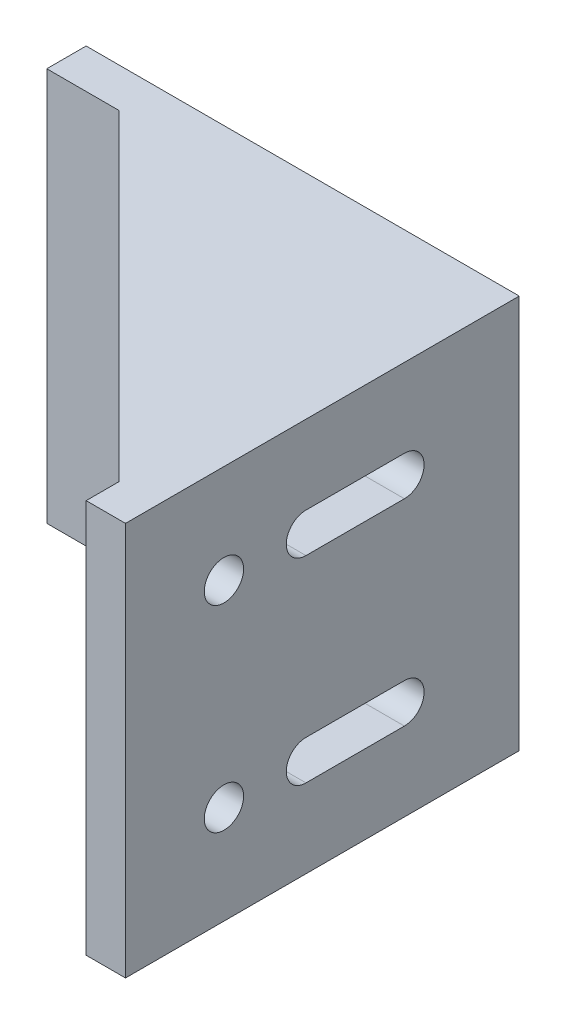
ISO-10303-21;
HEADER;
FILE_DESCRIPTION(('STEP AP214'),'2;1');
FILE_NAME('part.step','',(''),(''),'','','');
FILE_SCHEMA(('AUTOMOTIVE_DESIGN { 1 0 10303 214 1 1 1 1 }'));
ENDSEC;
DATA;
#1=APPLICATION_CONTEXT('core data for automotive mechanical design processes');
#2=APPLICATION_PROTOCOL_DEFINITION('international standard','automotive_design',2000,#1);
#3=PRODUCT_CONTEXT('',#1,'mechanical');
#4=PRODUCT('Part','Part','',(#3));
#5=PRODUCT_RELATED_PRODUCT_CATEGORY('part','',(#4));
#6=PRODUCT_DEFINITION_FORMATION('','',#4);
#7=PRODUCT_DEFINITION_CONTEXT('part definition',#1,'design');
#8=PRODUCT_DEFINITION('design','',#6,#7);
#9=PRODUCT_DEFINITION_SHAPE('','',#8);
#10=(LENGTH_UNIT() NAMED_UNIT(*) SI_UNIT(.MILLI.,.METRE.));
#11=(NAMED_UNIT(*) PLANE_ANGLE_UNIT() SI_UNIT($,.RADIAN.));
#12=(NAMED_UNIT(*) SI_UNIT($,.STERADIAN.) SOLID_ANGLE_UNIT());
#13=UNCERTAINTY_MEASURE_WITH_UNIT(LENGTH_MEASURE(1.E-05),#10,'distance_accuracy_value','');
#14=(GEOMETRIC_REPRESENTATION_CONTEXT(3) GLOBAL_UNCERTAINTY_ASSIGNED_CONTEXT((#13)) GLOBAL_UNIT_ASSIGNED_CONTEXT((#10,
#11,#12)) REPRESENTATION_CONTEXT('',''));
#15=CARTESIAN_POINT('',(0.,0.,0.));
#16=DIRECTION('',(0.,0.,1.));
#17=DIRECTION('',(1.,0.,0.));
#18=AXIS2_PLACEMENT_3D('',#15,#16,#17);
#19=CARTESIAN_POINT('',(0.,0.,6.));
#20=DIRECTION('',(0.,0.,-1.));
#21=DIRECTION('',(-1.,0.,0.));
#22=AXIS2_PLACEMENT_3D('',#19,#20,#21);
#23=PLANE('',#22);
#24=CARTESIAN_POINT('',(27.5,45.,6.));
#25=DIRECTION('',(0.,0.,1.));
#26=DIRECTION('',(1.,0.,0.));
#27=AXIS2_PLACEMENT_3D('',#24,#25,#26);
#28=CIRCLE('',#27,3.);
#29=CARTESIAN_POINT('',(27.5,48.,6.));
#30=VERTEX_POINT('',#29);
#31=CARTESIAN_POINT('',(27.5,42.,6.));
#32=VERTEX_POINT('',#31);
#33=EDGE_CURVE('E407',#30,#32,#28,.T.);
#34=ORIENTED_EDGE('',*,*,#33,.F.);
#35=DIRECTION('',(-1.,0.,0.));
#36=VECTOR('',#35,1.);
#37=CARTESIAN_POINT('',(27.5,48.,6.));
#38=LINE('',#37,#36);
#39=CARTESIAN_POINT('',(42.5,48.,6.));
#40=VERTEX_POINT('',#39);
#41=EDGE_CURVE('E415',#40,#30,#38,.T.);
#42=ORIENTED_EDGE('',*,*,#41,.F.);
#43=CARTESIAN_POINT('',(42.5,45.,6.));
#44=DIRECTION('',(0.,0.,1.));
#45=DIRECTION('',(1.,0.,0.));
#46=AXIS2_PLACEMENT_3D('',#43,#44,#45);
#47=CIRCLE('',#46,3.);
#48=CARTESIAN_POINT('',(42.5,42.,6.));
#49=VERTEX_POINT('',#48);
#50=EDGE_CURVE('E412',#49,#40,#47,.T.);
#51=ORIENTED_EDGE('',*,*,#50,.F.);
#52=DIRECTION('',(1.,0.,0.));
#53=VECTOR('',#52,1.);
#54=CARTESIAN_POINT('',(27.5,42.,6.));
#55=LINE('',#54,#53);
#56=EDGE_CURVE('E409',#32,#49,#55,.T.);
#57=ORIENTED_EDGE('',*,*,#56,.F.);
#58=EDGE_LOOP('',(#34,#42,#51,#57));
#59=FACE_BOUND('',#58,.T.);
#60=DIRECTION('',(1.,0.,0.));
#61=VECTOR('',#60,1.);
#62=CARTESIAN_POINT('',(60.,0.,6.));
#63=LINE('',#62,#61);
#64=CARTESIAN_POINT('',(0.,0.,6.));
#65=VERTEX_POINT('',#64);
#66=CARTESIAN_POINT('',(11.,0.,5.99999999999998));
#67=VERTEX_POINT('',#66);
#68=EDGE_CURVE('E236',#65,#67,#63,.T.);
#69=ORIENTED_EDGE('',*,*,#68,.T.);
#70=DIRECTION('',(0.,-1.,0.));
#71=VECTOR('',#70,1.);
#72=CARTESIAN_POINT('',(11.,3.,5.99999999999998));
#73=LINE('',#72,#71);
#74=CARTESIAN_POINT('',(11.,3.,5.99999999999998));
#75=VERTEX_POINT('',#74);
#76=EDGE_CURVE('E219',#75,#67,#73,.T.);
#77=ORIENTED_EDGE('',*,*,#76,.F.);
#78=DIRECTION('',(-1.,0.,0.));
#79=VECTOR('',#78,1.);
#80=CARTESIAN_POINT('',(0.,3.,6.));
#81=LINE('',#80,#79);
#82=CARTESIAN_POINT('',(60.,3.,6.));
#83=VERTEX_POINT('',#82);
#84=EDGE_CURVE('E224',#83,#75,#81,.T.);
#85=ORIENTED_EDGE('',*,*,#84,.F.);
#86=DIRECTION('',(0.,1.,0.));
#87=VECTOR('',#86,1.);
#88=CARTESIAN_POINT('',(60.,60.,6.));
#89=LINE('',#88,#87);
#90=CARTESIAN_POINT('',(60.,57.,6.));
#91=VERTEX_POINT('',#90);
#92=EDGE_CURVE('E230',#83,#91,#89,.T.);
#93=ORIENTED_EDGE('',*,*,#92,.T.);
#94=DIRECTION('',(1.,0.,0.));
#95=VECTOR('',#94,1.);
#96=CARTESIAN_POINT('',(0.,57.,6.));
#97=LINE('',#96,#95);
#98=CARTESIAN_POINT('',(11.,57.,6.));
#99=VERTEX_POINT('',#98);
#100=EDGE_CURVE('E262',#99,#91,#97,.T.);
#101=ORIENTED_EDGE('',*,*,#100,.F.);
#102=DIRECTION('',(0.,1.,0.));
#103=VECTOR('',#102,1.);
#104=CARTESIAN_POINT('',(11.,57.,6.));
#105=LINE('',#104,#103);
#106=CARTESIAN_POINT('',(11.,60.,6.));
#107=VERTEX_POINT('',#106);
#108=EDGE_CURVE('E268',#99,#107,#105,.T.);
#109=ORIENTED_EDGE('',*,*,#108,.T.);
#110=DIRECTION('',(-1.,0.,0.));
#111=VECTOR('',#110,1.);
#112=CARTESIAN_POINT('',(0.,60.,6.));
#113=LINE('',#112,#111);
#114=CARTESIAN_POINT('',(0.,60.,6.));
#115=VERTEX_POINT('',#114);
#116=EDGE_CURVE('E235',#107,#115,#113,.T.);
#117=ORIENTED_EDGE('',*,*,#116,.T.);
#118=DIRECTION('',(0.,-1.,0.));
#119=VECTOR('',#118,1.);
#120=CARTESIAN_POINT('',(0.,0.,6.));
#121=LINE('',#120,#119);
#122=EDGE_CURVE('E238',#115,#65,#121,.T.);
#123=ORIENTED_EDGE('',*,*,#122,.T.);
#124=EDGE_LOOP('',(#69,#77,#85,#93,#101,#109,#117,#123));
#125=FACE_BOUND('',#124,.T.);
#126=CARTESIAN_POINT('',(15.,45.,6.));
#127=DIRECTION('',(0.,0.,1.));
#128=DIRECTION('',(1.,0.,0.));
#129=AXIS2_PLACEMENT_3D('',#126,#127,#128);
#130=CIRCLE('',#129,3.);
#131=CARTESIAN_POINT('',(18.,45.,6.));
#132=VERTEX_POINT('',#131);
#133=EDGE_CURVE('E250',#132,#132,#130,.T.);
#134=ORIENTED_EDGE('',*,*,#133,.F.);
#135=EDGE_LOOP('',(#134));
#136=FACE_BOUND('',#135,.T.);
#137=CARTESIAN_POINT('',(27.5,15.,6.));
#138=DIRECTION('',(0.,0.,1.));
#139=DIRECTION('',(-1.,0.,0.));
#140=AXIS2_PLACEMENT_3D('',#137,#138,#139);
#141=CIRCLE('',#140,3.);
#142=CARTESIAN_POINT('',(27.5,18.,6.));
#143=VERTEX_POINT('',#142);
#144=CARTESIAN_POINT('',(27.5,12.,6.));
#145=VERTEX_POINT('',#144);
#146=EDGE_CURVE('E378',#143,#145,#141,.T.);
#147=ORIENTED_EDGE('',*,*,#146,.F.);
#148=DIRECTION('',(-1.,0.,0.));
#149=VECTOR('',#148,1.);
#150=CARTESIAN_POINT('',(27.5,18.,6.));
#151=LINE('',#150,#149);
#152=CARTESIAN_POINT('',(42.5,18.,6.));
#153=VERTEX_POINT('',#152);
#154=EDGE_CURVE('E385',#153,#143,#151,.T.);
#155=ORIENTED_EDGE('',*,*,#154,.F.);
#156=CARTESIAN_POINT('',(42.5,15.,6.));
#157=DIRECTION('',(0.,0.,1.));
#158=DIRECTION('',(-1.,0.,0.));
#159=AXIS2_PLACEMENT_3D('',#156,#157,#158);
#160=CIRCLE('',#159,3.);
#161=CARTESIAN_POINT('',(42.5,12.,6.));
#162=VERTEX_POINT('',#161);
#163=EDGE_CURVE('E383',#162,#153,#160,.T.);
#164=ORIENTED_EDGE('',*,*,#163,.F.);
#165=DIRECTION('',(1.,0.,0.));
#166=VECTOR('',#165,1.);
#167=CARTESIAN_POINT('',(27.5,12.,6.));
#168=LINE('',#167,#166);
#169=EDGE_CURVE('E380',#145,#162,#168,.T.);
#170=ORIENTED_EDGE('',*,*,#169,.F.);
#171=EDGE_LOOP('',(#147,#155,#164,#170));
#172=FACE_BOUND('',#171,.T.);
#173=CARTESIAN_POINT('',(15.,15.,6.));
#174=DIRECTION('',(0.,0.,1.));
#175=DIRECTION('',(-1.,0.,0.));
#176=AXIS2_PLACEMENT_3D('',#173,#174,#175);
#177=CIRCLE('',#176,3.);
#178=CARTESIAN_POINT('',(12.,15.,6.));
#179=VERTEX_POINT('',#178);
#180=EDGE_CURVE('E372',#179,#179,#177,.T.);
#181=ORIENTED_EDGE('',*,*,#180,.F.);
#182=EDGE_LOOP('',(#181));
#183=FACE_BOUND('',#182,.T.);
#184=ADVANCED_FACE('F36',(#59,#125,#136,#172,#183),#23,.F.);
#185=CARTESIAN_POINT('',(0.,0.,0.));
#186=DIRECTION('',(0.,0.,-1.));
#187=DIRECTION('',(-1.,0.,0.));
#188=AXIS2_PLACEMENT_3D('',#185,#186,#187);
#189=PLANE('',#188);
#190=DIRECTION('',(0.,1.,0.));
#191=VECTOR('',#190,1.);
#192=CARTESIAN_POINT('',(66.,0.,0.));
#193=LINE('',#192,#191);
#194=CARTESIAN_POINT('',(66.,0.,0.));
#195=VERTEX_POINT('',#194);
#196=CARTESIAN_POINT('',(66.,60.,0.));
#197=VERTEX_POINT('',#196);
#198=EDGE_CURVE('E351',#195,#197,#193,.T.);
#199=ORIENTED_EDGE('',*,*,#198,.F.);
#200=DIRECTION('',(1.,0.,0.));
#201=VECTOR('',#200,1.);
#202=CARTESIAN_POINT('',(60.,0.,0.));
#203=LINE('',#202,#201);
#204=CARTESIAN_POINT('',(0.,0.,0.));
#205=VERTEX_POINT('',#204);
#206=EDGE_CURVE('E247',#205,#195,#203,.T.);
#207=ORIENTED_EDGE('',*,*,#206,.F.);
#208=DIRECTION('',(0.,-1.,0.));
#209=VECTOR('',#208,1.);
#210=CARTESIAN_POINT('',(0.,0.,0.));
#211=LINE('',#210,#209);
#212=CARTESIAN_POINT('',(0.,60.,0.));
#213=VERTEX_POINT('',#212);
#214=EDGE_CURVE('E241',#213,#205,#211,.T.);
#215=ORIENTED_EDGE('',*,*,#214,.F.);
#216=DIRECTION('',(-1.,0.,0.));
#217=VECTOR('',#216,1.);
#218=CARTESIAN_POINT('',(0.,60.,0.));
#219=LINE('',#218,#217);
#220=EDGE_CURVE('E249',#197,#213,#219,.T.);
#221=ORIENTED_EDGE('',*,*,#220,.F.);
#222=EDGE_LOOP('',(#199,#207,#215,#221));
#223=FACE_BOUND('',#222,.T.);
#224=DIRECTION('',(-1.,0.,0.));
#225=VECTOR('',#224,1.);
#226=CARTESIAN_POINT('',(27.5,18.,0.));
#227=LINE('',#226,#225);
#228=CARTESIAN_POINT('',(42.5,18.,0.));
#229=VERTEX_POINT('',#228);
#230=CARTESIAN_POINT('',(27.5,18.,0.));
#231=VERTEX_POINT('',#230);
#232=EDGE_CURVE('E381',#229,#231,#227,.T.);
#233=ORIENTED_EDGE('',*,*,#232,.T.);
#234=CARTESIAN_POINT('',(27.5,15.,0.));
#235=DIRECTION('',(0.,0.,1.));
#236=DIRECTION('',(-1.,0.,0.));
#237=AXIS2_PLACEMENT_3D('',#234,#235,#236);
#238=CIRCLE('',#237,3.);
#239=CARTESIAN_POINT('',(27.5,12.,0.));
#240=VERTEX_POINT('',#239);
#241=EDGE_CURVE('E375',#231,#240,#238,.T.);
#242=ORIENTED_EDGE('',*,*,#241,.T.);
#243=DIRECTION('',(1.,0.,0.));
#244=VECTOR('',#243,1.);
#245=CARTESIAN_POINT('',(27.5,12.,0.));
#246=LINE('',#245,#244);
#247=CARTESIAN_POINT('',(42.5,12.,0.));
#248=VERTEX_POINT('',#247);
#249=EDGE_CURVE('E390',#240,#248,#246,.T.);
#250=ORIENTED_EDGE('',*,*,#249,.T.);
#251=CARTESIAN_POINT('',(42.5,15.,0.));
#252=DIRECTION('',(0.,0.,1.));
#253=DIRECTION('',(-1.,0.,0.));
#254=AXIS2_PLACEMENT_3D('',#251,#252,#253);
#255=CIRCLE('',#254,3.);
#256=EDGE_CURVE('E393',#248,#229,#255,.T.);
#257=ORIENTED_EDGE('',*,*,#256,.T.);
#258=EDGE_LOOP('',(#233,#242,#250,#257));
#259=FACE_BOUND('',#258,.T.);
#260=DIRECTION('',(-1.,0.,0.));
#261=VECTOR('',#260,1.);
#262=CARTESIAN_POINT('',(27.5,48.,0.));
#263=LINE('',#262,#261);
#264=CARTESIAN_POINT('',(42.5,48.,0.));
#265=VERTEX_POINT('',#264);
#266=CARTESIAN_POINT('',(27.5,48.,0.));
#267=VERTEX_POINT('',#266);
#268=EDGE_CURVE('E410',#265,#267,#263,.T.);
#269=ORIENTED_EDGE('',*,*,#268,.T.);
#270=CARTESIAN_POINT('',(27.5,45.,0.));
#271=DIRECTION('',(0.,0.,1.));
#272=DIRECTION('',(1.,0.,0.));
#273=AXIS2_PLACEMENT_3D('',#270,#271,#272);
#274=CIRCLE('',#273,3.);
#275=CARTESIAN_POINT('',(27.5,42.,0.));
#276=VERTEX_POINT('',#275);
#277=EDGE_CURVE('E406',#267,#276,#274,.T.);
#278=ORIENTED_EDGE('',*,*,#277,.T.);
#279=DIRECTION('',(1.,0.,0.));
#280=VECTOR('',#279,1.);
#281=CARTESIAN_POINT('',(27.5,42.,0.));
#282=LINE('',#281,#280);
#283=CARTESIAN_POINT('',(42.5,42.,0.));
#284=VERTEX_POINT('',#283);
#285=EDGE_CURVE('E420',#276,#284,#282,.T.);
#286=ORIENTED_EDGE('',*,*,#285,.T.);
#287=CARTESIAN_POINT('',(42.5,45.,0.));
#288=DIRECTION('',(0.,0.,1.));
#289=DIRECTION('',(1.,0.,0.));
#290=AXIS2_PLACEMENT_3D('',#287,#288,#289);
#291=CIRCLE('',#290,3.);
#292=EDGE_CURVE('E423',#284,#265,#291,.T.);
#293=ORIENTED_EDGE('',*,*,#292,.T.);
#294=EDGE_LOOP('',(#269,#278,#286,#293));
#295=FACE_BOUND('',#294,.T.);
#296=CARTESIAN_POINT('',(15.,45.,0.));
#297=DIRECTION('',(0.,0.,1.));
#298=DIRECTION('',(1.,0.,0.));
#299=AXIS2_PLACEMENT_3D('',#296,#297,#298);
#300=CIRCLE('',#299,3.);
#301=CARTESIAN_POINT('',(18.,45.,0.));
#302=VERTEX_POINT('',#301);
#303=EDGE_CURVE('E437',#302,#302,#300,.T.);
#304=ORIENTED_EDGE('',*,*,#303,.T.);
#305=EDGE_LOOP('',(#304));
#306=FACE_BOUND('',#305,.T.);
#307=CARTESIAN_POINT('',(15.,15.,0.));
#308=DIRECTION('',(0.,0.,1.));
#309=DIRECTION('',(-1.,0.,0.));
#310=AXIS2_PLACEMENT_3D('',#307,#308,#309);
#311=CIRCLE('',#310,3.);
#312=CARTESIAN_POINT('',(12.,15.,0.));
#313=VERTEX_POINT('',#312);
#314=EDGE_CURVE('E371',#313,#313,#311,.T.);
#315=ORIENTED_EDGE('',*,*,#314,.T.);
#316=EDGE_LOOP('',(#315));
#317=FACE_BOUND('',#316,.T.);
#318=ADVANCED_FACE('F442',(#223,#259,#295,#306,#317),#189,.T.);
#319=CARTESIAN_POINT('',(60.,0.,6.));
#320=DIRECTION('',(0.,1.,0.));
#321=DIRECTION('',(-1.,0.,0.));
#322=AXIS2_PLACEMENT_3D('',#319,#320,#321);
#323=PLANE('',#322);
#324=DIRECTION('',(-0.707106781186547,0.,-0.707106781186548));
#325=VECTOR('',#324,1.);
#326=CARTESIAN_POINT('',(60.,0.,55.));
#327=LINE('',#326,#325);
#328=CARTESIAN_POINT('',(60.,0.,55.));
#329=VERTEX_POINT('',#328);
#330=EDGE_CURVE('E214',#329,#67,#327,.T.);
#331=ORIENTED_EDGE('',*,*,#330,.T.);
#332=ORIENTED_EDGE('',*,*,#68,.F.);
#333=DIRECTION('',(0.,0.,-1.));
#334=VECTOR('',#333,1.);
#335=CARTESIAN_POINT('',(0.,0.,6.));
#336=LINE('',#335,#334);
#337=EDGE_CURVE('E246',#65,#205,#336,.T.);
#338=ORIENTED_EDGE('',*,*,#337,.T.);
#339=ORIENTED_EDGE('',*,*,#206,.T.);
#340=DIRECTION('',(0.,0.,-1.));
#341=VECTOR('',#340,1.);
#342=CARTESIAN_POINT('',(66.,0.,0.));
#343=LINE('',#342,#341);
#344=CARTESIAN_POINT('',(66.,0.,60.));
#345=VERTEX_POINT('',#344);
#346=EDGE_CURVE('E358',#345,#195,#343,.T.);
#347=ORIENTED_EDGE('',*,*,#346,.F.);
#348=DIRECTION('',(-1.,0.,0.));
#349=VECTOR('',#348,1.);
#350=CARTESIAN_POINT('',(66.,0.,60.));
#351=LINE('',#350,#349);
#352=CARTESIAN_POINT('',(60.,0.,60.));
#353=VERTEX_POINT('',#352);
#354=EDGE_CURVE('E361',#345,#353,#351,.T.);
#355=ORIENTED_EDGE('',*,*,#354,.T.);
#356=DIRECTION('',(0.,0.,-1.));
#357=VECTOR('',#356,1.);
#358=CARTESIAN_POINT('',(60.,0.,0.));
#359=LINE('',#358,#357);
#360=EDGE_CURVE('E354',#353,#329,#359,.T.);
#361=ORIENTED_EDGE('',*,*,#360,.T.);
#362=EDGE_LOOP('',(#331,#332,#338,#339,#347,#355,#361));
#363=FACE_BOUND('',#362,.T.);
#364=ADVANCED_FACE('F38',(#363),#323,.F.);
#365=CARTESIAN_POINT('',(0.,60.,6.));
#366=DIRECTION('',(0.,-1.,0.));
#367=DIRECTION('',(0.,0.,-1.));
#368=AXIS2_PLACEMENT_3D('',#365,#366,#367);
#369=PLANE('',#368);
#370=ORIENTED_EDGE('',*,*,#116,.F.);
#371=DIRECTION('',(0.707106781186547,0.,0.707106781186547));
#372=VECTOR('',#371,1.);
#373=CARTESIAN_POINT('',(11.,60.,6.));
#374=LINE('',#373,#372);
#375=CARTESIAN_POINT('',(60.,60.,55.));
#376=VERTEX_POINT('',#375);
#377=EDGE_CURVE('E51',#107,#376,#374,.T.);
#378=ORIENTED_EDGE('',*,*,#377,.T.);
#379=DIRECTION('',(0.,0.,1.));
#380=VECTOR('',#379,1.);
#381=CARTESIAN_POINT('',(60.,60.,0.));
#382=LINE('',#381,#380);
#383=CARTESIAN_POINT('',(60.,60.,60.));
#384=VERTEX_POINT('',#383);
#385=EDGE_CURVE('E271',#376,#384,#382,.T.);
#386=ORIENTED_EDGE('',*,*,#385,.T.);
#387=DIRECTION('',(-1.,0.,0.));
#388=VECTOR('',#387,1.);
#389=CARTESIAN_POINT('',(66.,60.,60.));
#390=LINE('',#389,#388);
#391=CARTESIAN_POINT('',(66.,60.,60.));
#392=VERTEX_POINT('',#391);
#393=EDGE_CURVE('E368',#392,#384,#390,.T.);
#394=ORIENTED_EDGE('',*,*,#393,.F.);
#395=DIRECTION('',(0.,0.,1.));
#396=VECTOR('',#395,1.);
#397=CARTESIAN_POINT('',(66.,60.,0.));
#398=LINE('',#397,#396);
#399=EDGE_CURVE('E353',#197,#392,#398,.T.);
#400=ORIENTED_EDGE('',*,*,#399,.F.);
#401=ORIENTED_EDGE('',*,*,#220,.T.);
#402=DIRECTION('',(0.,0.,-1.));
#403=VECTOR('',#402,1.);
#404=CARTESIAN_POINT('',(0.,60.,6.));
#405=LINE('',#404,#403);
#406=EDGE_CURVE('E255',#115,#213,#405,.T.);
#407=ORIENTED_EDGE('',*,*,#406,.F.);
#408=EDGE_LOOP('',(#370,#378,#386,#394,#400,#401,#407));
#409=FACE_BOUND('',#408,.T.);
#410=ADVANCED_FACE('F458',(#409),#369,.F.);
#411=CARTESIAN_POINT('',(0.,0.,6.));
#412=DIRECTION('',(1.,0.,0.));
#413=DIRECTION('',(0.,0.,-1.));
#414=AXIS2_PLACEMENT_3D('',#411,#412,#413);
#415=PLANE('',#414);
#416=ORIENTED_EDGE('',*,*,#214,.T.);
#417=ORIENTED_EDGE('',*,*,#337,.F.);
#418=ORIENTED_EDGE('',*,*,#122,.F.);
#419=ORIENTED_EDGE('',*,*,#406,.T.);
#420=EDGE_LOOP('',(#416,#417,#418,#419));
#421=FACE_BOUND('',#420,.T.);
#422=ADVANCED_FACE('F448',(#421),#415,.F.);
#423=CARTESIAN_POINT('',(15.,45.,6.));
#424=DIRECTION('',(0.,0.,-1.));
#425=DIRECTION('',(-1.,0.,0.));
#426=AXIS2_PLACEMENT_3D('',#423,#424,#425);
#427=CYLINDRICAL_SURFACE('',#426,3.);
#428=ORIENTED_EDGE('',*,*,#133,.T.);
#429=EDGE_LOOP('',(#428));
#430=FACE_BOUND('',#429,.T.);
#431=ORIENTED_EDGE('',*,*,#303,.F.);
#432=EDGE_LOOP('',(#431));
#433=FACE_BOUND('',#432,.T.);
#434=ADVANCED_FACE('F445',(#430,#433),#427,.F.);
#435=CARTESIAN_POINT('',(27.5,45.,6.));
#436=DIRECTION('',(0.,0.,-1.));
#437=DIRECTION('',(-1.,0.,0.));
#438=AXIS2_PLACEMENT_3D('',#435,#436,#437);
#439=CYLINDRICAL_SURFACE('',#438,3.);
#440=ORIENTED_EDGE('',*,*,#277,.F.);
#441=DIRECTION('',(0.,0.,-1.));
#442=VECTOR('',#441,1.);
#443=CARTESIAN_POINT('',(27.5,48.,6.));
#444=LINE('',#443,#442);
#445=EDGE_CURVE('E417',#30,#267,#444,.T.);
#446=ORIENTED_EDGE('',*,*,#445,.F.);
#447=ORIENTED_EDGE('',*,*,#33,.T.);
#448=DIRECTION('',(0.,0.,-1.));
#449=VECTOR('',#448,1.);
#450=CARTESIAN_POINT('',(27.5,42.,6.));
#451=LINE('',#450,#449);
#452=EDGE_CURVE('E434',#32,#276,#451,.T.);
#453=ORIENTED_EDGE('',*,*,#452,.T.);
#454=EDGE_LOOP('',(#440,#446,#447,#453));
#455=FACE_BOUND('',#454,.T.);
#456=ADVANCED_FACE('F447',(#455),#439,.F.);
#457=CARTESIAN_POINT('',(27.5,42.,6.));
#458=DIRECTION('',(0.,1.,0.));
#459=DIRECTION('',(0.,0.,1.));
#460=AXIS2_PLACEMENT_3D('',#457,#458,#459);
#461=PLANE('',#460);
#462=ORIENTED_EDGE('',*,*,#285,.F.);
#463=ORIENTED_EDGE('',*,*,#452,.F.);
#464=ORIENTED_EDGE('',*,*,#56,.T.);
#465=DIRECTION('',(0.,0.,-1.));
#466=VECTOR('',#465,1.);
#467=CARTESIAN_POINT('',(42.5,42.,6.));
#468=LINE('',#467,#466);
#469=EDGE_CURVE('E432',#49,#284,#468,.T.);
#470=ORIENTED_EDGE('',*,*,#469,.T.);
#471=EDGE_LOOP('',(#462,#463,#464,#470));
#472=FACE_BOUND('',#471,.T.);
#473=ADVANCED_FACE('F455',(#472),#461,.T.);
#474=CARTESIAN_POINT('',(42.5,45.,6.));
#475=DIRECTION('',(0.,0.,-1.));
#476=DIRECTION('',(-1.,0.,0.));
#477=AXIS2_PLACEMENT_3D('',#474,#475,#476);
#478=CYLINDRICAL_SURFACE('',#477,3.);
#479=ORIENTED_EDGE('',*,*,#292,.F.);
#480=ORIENTED_EDGE('',*,*,#469,.F.);
#481=ORIENTED_EDGE('',*,*,#50,.T.);
#482=DIRECTION('',(0.,0.,-1.));
#483=VECTOR('',#482,1.);
#484=CARTESIAN_POINT('',(42.5,48.,6.));
#485=LINE('',#484,#483);
#486=EDGE_CURVE('E430',#40,#265,#485,.T.);
#487=ORIENTED_EDGE('',*,*,#486,.T.);
#488=EDGE_LOOP('',(#479,#480,#481,#487));
#489=FACE_BOUND('',#488,.T.);
#490=ADVANCED_FACE('F511',(#489),#478,.F.);
#491=CARTESIAN_POINT('',(27.5,48.,6.));
#492=DIRECTION('',(0.,-1.,0.));
#493=DIRECTION('',(0.,0.,-1.));
#494=AXIS2_PLACEMENT_3D('',#491,#492,#493);
#495=PLANE('',#494);
#496=ORIENTED_EDGE('',*,*,#268,.F.);
#497=ORIENTED_EDGE('',*,*,#486,.F.);
#498=ORIENTED_EDGE('',*,*,#41,.T.);
#499=ORIENTED_EDGE('',*,*,#445,.T.);
#500=EDGE_LOOP('',(#496,#497,#498,#499));
#501=FACE_BOUND('',#500,.T.);
#502=ADVANCED_FACE('F502',(#501),#495,.T.);
#503=CARTESIAN_POINT('',(27.5,15.,6.));
#504=DIRECTION('',(0.,0.,-1.));
#505=DIRECTION('',(-1.,0.,0.));
#506=AXIS2_PLACEMENT_3D('',#503,#504,#505);
#507=CYLINDRICAL_SURFACE('',#506,3.);
#508=ORIENTED_EDGE('',*,*,#241,.F.);
#509=DIRECTION('',(0.,0.,-1.));
#510=VECTOR('',#509,1.);
#511=CARTESIAN_POINT('',(27.5,18.,6.));
#512=LINE('',#511,#510);
#513=EDGE_CURVE('E387',#143,#231,#512,.T.);
#514=ORIENTED_EDGE('',*,*,#513,.F.);
#515=ORIENTED_EDGE('',*,*,#146,.T.);
#516=DIRECTION('',(0.,0.,-1.));
#517=VECTOR('',#516,1.);
#518=CARTESIAN_POINT('',(27.5,12.,6.));
#519=LINE('',#518,#517);
#520=EDGE_CURVE('E403',#145,#240,#519,.T.);
#521=ORIENTED_EDGE('',*,*,#520,.T.);
#522=EDGE_LOOP('',(#508,#514,#515,#521));
#523=FACE_BOUND('',#522,.T.);
#524=ADVANCED_FACE('F518',(#523),#507,.F.);
#525=CARTESIAN_POINT('',(27.5,12.,6.));
#526=DIRECTION('',(0.,1.,0.));
#527=DIRECTION('',(0.,0.,1.));
#528=AXIS2_PLACEMENT_3D('',#525,#526,#527);
#529=PLANE('',#528);
#530=ORIENTED_EDGE('',*,*,#249,.F.);
#531=ORIENTED_EDGE('',*,*,#520,.F.);
#532=ORIENTED_EDGE('',*,*,#169,.T.);
#533=DIRECTION('',(0.,0.,-1.));
#534=VECTOR('',#533,1.);
#535=CARTESIAN_POINT('',(42.5,12.,6.));
#536=LINE('',#535,#534);
#537=EDGE_CURVE('E401',#162,#248,#536,.T.);
#538=ORIENTED_EDGE('',*,*,#537,.T.);
#539=EDGE_LOOP('',(#530,#531,#532,#538));
#540=FACE_BOUND('',#539,.T.);
#541=ADVANCED_FACE('F524',(#540),#529,.T.);
#542=CARTESIAN_POINT('',(42.5,15.,6.));
#543=DIRECTION('',(0.,0.,-1.));
#544=DIRECTION('',(-1.,0.,0.));
#545=AXIS2_PLACEMENT_3D('',#542,#543,#544);
#546=CYLINDRICAL_SURFACE('',#545,3.);
#547=ORIENTED_EDGE('',*,*,#256,.F.);
#548=ORIENTED_EDGE('',*,*,#537,.F.);
#549=ORIENTED_EDGE('',*,*,#163,.T.);
#550=DIRECTION('',(0.,0.,-1.));
#551=VECTOR('',#550,1.);
#552=CARTESIAN_POINT('',(42.5,18.,6.));
#553=LINE('',#552,#551);
#554=EDGE_CURVE('E59',#153,#229,#553,.T.);
#555=ORIENTED_EDGE('',*,*,#554,.T.);
#556=EDGE_LOOP('',(#547,#548,#549,#555));
#557=FACE_BOUND('',#556,.T.);
#558=ADVANCED_FACE('F528',(#557),#546,.F.);
#559=CARTESIAN_POINT('',(27.5,18.,6.));
#560=DIRECTION('',(0.,-1.,0.));
#561=DIRECTION('',(0.,0.,-1.));
#562=AXIS2_PLACEMENT_3D('',#559,#560,#561);
#563=PLANE('',#562);
#564=ORIENTED_EDGE('',*,*,#232,.F.);
#565=ORIENTED_EDGE('',*,*,#554,.F.);
#566=ORIENTED_EDGE('',*,*,#154,.T.);
#567=ORIENTED_EDGE('',*,*,#513,.T.);
#568=EDGE_LOOP('',(#564,#565,#566,#567));
#569=FACE_BOUND('',#568,.T.);
#570=ADVANCED_FACE('F532',(#569),#563,.T.);
#571=CARTESIAN_POINT('',(15.,15.,6.));
#572=DIRECTION('',(0.,0.,-1.));
#573=DIRECTION('',(-1.,0.,0.));
#574=AXIS2_PLACEMENT_3D('',#571,#572,#573);
#575=CYLINDRICAL_SURFACE('',#574,3.);
#576=ORIENTED_EDGE('',*,*,#180,.T.);
#577=EDGE_LOOP('',(#576));
#578=FACE_BOUND('',#577,.T.);
#579=ORIENTED_EDGE('',*,*,#314,.F.);
#580=EDGE_LOOP('',(#579));
#581=FACE_BOUND('',#580,.T.);
#582=ADVANCED_FACE('F536',(#578,#581),#575,.F.);
#583=CARTESIAN_POINT('',(66.,0.,0.));
#584=DIRECTION('',(1.,0.,0.));
#585=DIRECTION('',(0.,1.,0.));
#586=AXIS2_PLACEMENT_3D('',#583,#584,#585);
#587=PLANE('',#586);
#588=ORIENTED_EDGE('',*,*,#346,.T.);
#589=ORIENTED_EDGE('',*,*,#198,.T.);
#590=ORIENTED_EDGE('',*,*,#399,.T.);
#591=DIRECTION('',(0.,-1.,0.));
#592=VECTOR('',#591,1.);
#593=CARTESIAN_POINT('',(66.,0.,60.));
#594=LINE('',#593,#592);
#595=EDGE_CURVE('E356',#392,#345,#594,.T.);
#596=ORIENTED_EDGE('',*,*,#595,.T.);
#597=EDGE_LOOP('',(#588,#589,#590,#596));
#598=FACE_BOUND('',#597,.T.);
#599=DIRECTION('',(0.,0.,-1.));
#600=VECTOR('',#599,1.);
#601=CARTESIAN_POINT('',(66.,42.,32.5));
#602=LINE('',#601,#600);
#603=CARTESIAN_POINT('',(66.,42.,32.5));
#604=VERTEX_POINT('',#603);
#605=CARTESIAN_POINT('',(66.,42.,17.5));
#606=VERTEX_POINT('',#605);
#607=EDGE_CURVE('E286',#604,#606,#602,.T.);
#608=ORIENTED_EDGE('',*,*,#607,.F.);
#609=CARTESIAN_POINT('',(66.,45.,32.5));
#610=DIRECTION('',(1.,0.,0.));
#611=DIRECTION('',(0.,1.,0.));
#612=AXIS2_PLACEMENT_3D('',#609,#610,#611);
#613=CIRCLE('',#612,3.);
#614=CARTESIAN_POINT('',(66.,48.,32.5));
#615=VERTEX_POINT('',#614);
#616=EDGE_CURVE('E284',#615,#604,#613,.T.);
#617=ORIENTED_EDGE('',*,*,#616,.F.);
#618=DIRECTION('',(0.,0.,1.));
#619=VECTOR('',#618,1.);
#620=CARTESIAN_POINT('',(66.,48.,32.5));
#621=LINE('',#620,#619);
#622=CARTESIAN_POINT('',(66.,48.,17.5));
#623=VERTEX_POINT('',#622);
#624=EDGE_CURVE('E292',#623,#615,#621,.T.);
#625=ORIENTED_EDGE('',*,*,#624,.F.);
#626=CARTESIAN_POINT('',(66.,45.,17.5));
#627=DIRECTION('',(1.,0.,0.));
#628=DIRECTION('',(0.,1.,0.));
#629=AXIS2_PLACEMENT_3D('',#626,#627,#628);
#630=CIRCLE('',#629,3.);
#631=EDGE_CURVE('E289',#606,#623,#630,.T.);
#632=ORIENTED_EDGE('',*,*,#631,.F.);
#633=EDGE_LOOP('',(#608,#617,#625,#632));
#634=FACE_BOUND('',#633,.T.);
#635=DIRECTION('',(0.,0.,-1.));
#636=VECTOR('',#635,1.);
#637=CARTESIAN_POINT('',(66.,12.,32.5));
#638=LINE('',#637,#636);
#639=CARTESIAN_POINT('',(66.,12.,32.5));
#640=VERTEX_POINT('',#639);
#641=CARTESIAN_POINT('',(66.,12.,17.5));
#642=VERTEX_POINT('',#641);
#643=EDGE_CURVE('E317',#640,#642,#638,.T.);
#644=ORIENTED_EDGE('',*,*,#643,.F.);
#645=CARTESIAN_POINT('',(66.,15.,32.5));
#646=DIRECTION('',(1.,0.,0.));
#647=DIRECTION('',(0.,-1.,0.));
#648=AXIS2_PLACEMENT_3D('',#645,#646,#647);
#649=CIRCLE('',#648,3.);
#650=CARTESIAN_POINT('',(66.,18.,32.5));
#651=VERTEX_POINT('',#650);
#652=EDGE_CURVE('E315',#651,#640,#649,.T.);
#653=ORIENTED_EDGE('',*,*,#652,.F.);
#654=DIRECTION('',(0.,0.,1.));
#655=VECTOR('',#654,1.);
#656=CARTESIAN_POINT('',(66.,18.,32.5));
#657=LINE('',#656,#655);
#658=CARTESIAN_POINT('',(66.,18.,17.5));
#659=VERTEX_POINT('',#658);
#660=EDGE_CURVE('E323',#659,#651,#657,.T.);
#661=ORIENTED_EDGE('',*,*,#660,.F.);
#662=CARTESIAN_POINT('',(66.,15.,17.5));
#663=DIRECTION('',(1.,0.,0.));
#664=DIRECTION('',(0.,-1.,0.));
#665=AXIS2_PLACEMENT_3D('',#662,#663,#664);
#666=CIRCLE('',#665,3.);
#667=EDGE_CURVE('E320',#642,#659,#666,.T.);
#668=ORIENTED_EDGE('',*,*,#667,.F.);
#669=EDGE_LOOP('',(#644,#653,#661,#668));
#670=FACE_BOUND('',#669,.T.);
#671=CARTESIAN_POINT('',(66.,45.,45.));
#672=DIRECTION('',(1.,0.,0.));
#673=DIRECTION('',(0.,1.,0.));
#674=AXIS2_PLACEMENT_3D('',#671,#672,#673);
#675=CIRCLE('',#674,3.);
#676=CARTESIAN_POINT('',(66.,48.,45.));
#677=VERTEX_POINT('',#676);
#678=EDGE_CURVE('E346',#677,#677,#675,.T.);
#679=ORIENTED_EDGE('',*,*,#678,.F.);
#680=EDGE_LOOP('',(#679));
#681=FACE_BOUND('',#680,.T.);
#682=CARTESIAN_POINT('',(66.,15.,45.));
#683=DIRECTION('',(1.,0.,0.));
#684=DIRECTION('',(0.,-1.,0.));
#685=AXIS2_PLACEMENT_3D('',#682,#683,#684);
#686=CIRCLE('',#685,3.00000000000001);
#687=CARTESIAN_POINT('',(66.,12.,45.));
#688=VERTEX_POINT('',#687);
#689=EDGE_CURVE('E278',#688,#688,#686,.T.);
#690=ORIENTED_EDGE('',*,*,#689,.F.);
#691=EDGE_LOOP('',(#690));
#692=FACE_BOUND('',#691,.T.);
#693=ADVANCED_FACE('F494',(#598,#634,#670,#681,#692),#587,.T.);
#694=CARTESIAN_POINT('',(60.,0.,0.));
#695=DIRECTION('',(1.,0.,0.));
#696=DIRECTION('',(0.,1.,0.));
#697=AXIS2_PLACEMENT_3D('',#694,#695,#696);
#698=PLANE('',#697);
#699=DIRECTION('',(0.,0.,-1.));
#700=VECTOR('',#699,1.);
#701=CARTESIAN_POINT('',(60.,3.,0.));
#702=LINE('',#701,#700);
#703=CARTESIAN_POINT('',(60.,3.,55.));
#704=VERTEX_POINT('',#703);
#705=EDGE_CURVE('E11',#704,#83,#702,.T.);
#706=ORIENTED_EDGE('',*,*,#705,.F.);
#707=DIRECTION('',(0.,-1.,0.));
#708=VECTOR('',#707,1.);
#709=CARTESIAN_POINT('',(60.,3.,55.));
#710=LINE('',#709,#708);
#711=EDGE_CURVE('E208',#704,#329,#710,.T.);
#712=ORIENTED_EDGE('',*,*,#711,.T.);
#713=ORIENTED_EDGE('',*,*,#360,.F.);
#714=DIRECTION('',(0.,-1.,0.));
#715=VECTOR('',#714,1.);
#716=CARTESIAN_POINT('',(60.,0.,60.));
#717=LINE('',#716,#715);
#718=EDGE_CURVE('E363',#384,#353,#717,.T.);
#719=ORIENTED_EDGE('',*,*,#718,.F.);
#720=ORIENTED_EDGE('',*,*,#385,.F.);
#721=DIRECTION('',(0.,1.,0.));
#722=VECTOR('',#721,1.);
#723=CARTESIAN_POINT('',(60.,57.,55.));
#724=LINE('',#723,#722);
#725=CARTESIAN_POINT('',(60.,57.,55.));
#726=VERTEX_POINT('',#725);
#727=EDGE_CURVE('E265',#726,#376,#724,.T.);
#728=ORIENTED_EDGE('',*,*,#727,.F.);
#729=DIRECTION('',(0.,0.,1.));
#730=VECTOR('',#729,1.);
#731=CARTESIAN_POINT('',(60.,57.,0.));
#732=LINE('',#731,#730);
#733=EDGE_CURVE('E44',#91,#726,#732,.T.);
#734=ORIENTED_EDGE('',*,*,#733,.F.);
#735=ORIENTED_EDGE('',*,*,#92,.F.);
#736=EDGE_LOOP('',(#706,#712,#713,#719,#720,#728,#734,#735));
#737=FACE_BOUND('',#736,.T.);
#738=CARTESIAN_POINT('',(60.,15.,32.5));
#739=DIRECTION('',(1.,0.,0.));
#740=DIRECTION('',(0.,-1.,0.));
#741=AXIS2_PLACEMENT_3D('',#738,#739,#740);
#742=CIRCLE('',#741,3.);
#743=CARTESIAN_POINT('',(60.,18.,32.5));
#744=VERTEX_POINT('',#743);
#745=CARTESIAN_POINT('',(60.,12.,32.5));
#746=VERTEX_POINT('',#745);
#747=EDGE_CURVE('E314',#744,#746,#742,.T.);
#748=ORIENTED_EDGE('',*,*,#747,.T.);
#749=DIRECTION('',(0.,0.,-1.));
#750=VECTOR('',#749,1.);
#751=CARTESIAN_POINT('',(60.,12.,32.5));
#752=LINE('',#751,#750);
#753=CARTESIAN_POINT('',(60.,12.,17.5));
#754=VERTEX_POINT('',#753);
#755=EDGE_CURVE('E328',#746,#754,#752,.T.);
#756=ORIENTED_EDGE('',*,*,#755,.T.);
#757=CARTESIAN_POINT('',(60.,15.,17.5));
#758=DIRECTION('',(1.,0.,0.));
#759=DIRECTION('',(0.,-1.,0.));
#760=AXIS2_PLACEMENT_3D('',#757,#758,#759);
#761=CIRCLE('',#760,3.);
#762=CARTESIAN_POINT('',(60.,18.,17.5));
#763=VERTEX_POINT('',#762);
#764=EDGE_CURVE('E331',#754,#763,#761,.T.);
#765=ORIENTED_EDGE('',*,*,#764,.T.);
#766=DIRECTION('',(0.,0.,1.));
#767=VECTOR('',#766,1.);
#768=CARTESIAN_POINT('',(60.,18.,32.5));
#769=LINE('',#768,#767);
#770=EDGE_CURVE('E318',#763,#744,#769,.T.);
#771=ORIENTED_EDGE('',*,*,#770,.T.);
#772=EDGE_LOOP('',(#748,#756,#765,#771));
#773=FACE_BOUND('',#772,.T.);
#774=CARTESIAN_POINT('',(60.,45.,45.));
#775=DIRECTION('',(1.,0.,0.));
#776=DIRECTION('',(0.,1.,0.));
#777=AXIS2_PLACEMENT_3D('',#774,#775,#776);
#778=CIRCLE('',#777,3.);
#779=CARTESIAN_POINT('',(60.,48.,45.));
#780=VERTEX_POINT('',#779);
#781=EDGE_CURVE('E345',#780,#780,#778,.T.);
#782=ORIENTED_EDGE('',*,*,#781,.T.);
#783=EDGE_LOOP('',(#782));
#784=FACE_BOUND('',#783,.T.);
#785=CARTESIAN_POINT('',(60.,45.,32.5));
#786=DIRECTION('',(1.,0.,0.));
#787=DIRECTION('',(0.,1.,0.));
#788=AXIS2_PLACEMENT_3D('',#785,#786,#787);
#789=CIRCLE('',#788,3.);
#790=CARTESIAN_POINT('',(60.,48.,32.5));
#791=VERTEX_POINT('',#790);
#792=CARTESIAN_POINT('',(60.,42.,32.5));
#793=VERTEX_POINT('',#792);
#794=EDGE_CURVE('E281',#791,#793,#789,.T.);
#795=ORIENTED_EDGE('',*,*,#794,.T.);
#796=DIRECTION('',(0.,0.,-1.));
#797=VECTOR('',#796,1.);
#798=CARTESIAN_POINT('',(60.,42.,32.5));
#799=LINE('',#798,#797);
#800=CARTESIAN_POINT('',(60.,42.,17.5));
#801=VERTEX_POINT('',#800);
#802=EDGE_CURVE('E297',#793,#801,#799,.T.);
#803=ORIENTED_EDGE('',*,*,#802,.T.);
#804=CARTESIAN_POINT('',(60.,45.,17.5));
#805=DIRECTION('',(1.,0.,0.));
#806=DIRECTION('',(0.,1.,0.));
#807=AXIS2_PLACEMENT_3D('',#804,#805,#806);
#808=CIRCLE('',#807,3.);
#809=CARTESIAN_POINT('',(60.,48.,17.5));
#810=VERTEX_POINT('',#809);
#811=EDGE_CURVE('E300',#801,#810,#808,.T.);
#812=ORIENTED_EDGE('',*,*,#811,.T.);
#813=DIRECTION('',(0.,0.,1.));
#814=VECTOR('',#813,1.);
#815=CARTESIAN_POINT('',(60.,48.,32.5));
#816=LINE('',#815,#814);
#817=EDGE_CURVE('E287',#810,#791,#816,.T.);
#818=ORIENTED_EDGE('',*,*,#817,.T.);
#819=EDGE_LOOP('',(#795,#803,#812,#818));
#820=FACE_BOUND('',#819,.T.);
#821=CARTESIAN_POINT('',(60.,15.,45.));
#822=DIRECTION('',(1.,0.,0.));
#823=DIRECTION('',(0.,-1.,0.));
#824=AXIS2_PLACEMENT_3D('',#821,#822,#823);
#825=CIRCLE('',#824,3.00000000000001);
#826=CARTESIAN_POINT('',(60.,12.,45.));
#827=VERTEX_POINT('',#826);
#828=EDGE_CURVE('E273',#827,#827,#825,.T.);
#829=ORIENTED_EDGE('',*,*,#828,.T.);
#830=EDGE_LOOP('',(#829));
#831=FACE_BOUND('',#830,.T.);
#832=ADVANCED_FACE('F227',(#737,#773,#784,#820,#831),#698,.F.);
#833=CARTESIAN_POINT('',(66.,0.,60.));
#834=DIRECTION('',(0.,0.,-1.));
#835=DIRECTION('',(0.,1.,0.));
#836=AXIS2_PLACEMENT_3D('',#833,#834,#835);
#837=PLANE('',#836);
#838=ORIENTED_EDGE('',*,*,#718,.T.);
#839=ORIENTED_EDGE('',*,*,#354,.F.);
#840=ORIENTED_EDGE('',*,*,#595,.F.);
#841=ORIENTED_EDGE('',*,*,#393,.T.);
#842=EDGE_LOOP('',(#838,#839,#840,#841));
#843=FACE_BOUND('',#842,.T.);
#844=ADVANCED_FACE('F488',(#843),#837,.F.);
#845=CARTESIAN_POINT('',(66.,45.,45.));
#846=DIRECTION('',(-1.,0.,0.));
#847=DIRECTION('',(0.,-1.,0.));
#848=AXIS2_PLACEMENT_3D('',#845,#846,#847);
#849=CYLINDRICAL_SURFACE('',#848,3.);
#850=ORIENTED_EDGE('',*,*,#678,.T.);
#851=EDGE_LOOP('',(#850));
#852=FACE_BOUND('',#851,.T.);
#853=ORIENTED_EDGE('',*,*,#781,.F.);
#854=EDGE_LOOP('',(#853));
#855=FACE_BOUND('',#854,.T.);
#856=ADVANCED_FACE('F542',(#852,#855),#849,.F.);
#857=CARTESIAN_POINT('',(66.,15.,32.5));
#858=DIRECTION('',(-1.,0.,0.));
#859=DIRECTION('',(0.,-1.,0.));
#860=AXIS2_PLACEMENT_3D('',#857,#858,#859);
#861=CYLINDRICAL_SURFACE('',#860,3.);
#862=ORIENTED_EDGE('',*,*,#747,.F.);
#863=DIRECTION('',(-1.,0.,0.));
#864=VECTOR('',#863,1.);
#865=CARTESIAN_POINT('',(66.,18.,32.5));
#866=LINE('',#865,#864);
#867=EDGE_CURVE('E325',#651,#744,#866,.T.);
#868=ORIENTED_EDGE('',*,*,#867,.F.);
#869=ORIENTED_EDGE('',*,*,#652,.T.);
#870=DIRECTION('',(-1.,0.,0.));
#871=VECTOR('',#870,1.);
#872=CARTESIAN_POINT('',(66.,12.,32.5));
#873=LINE('',#872,#871);
#874=EDGE_CURVE('E342',#640,#746,#873,.T.);
#875=ORIENTED_EDGE('',*,*,#874,.T.);
#876=EDGE_LOOP('',(#862,#868,#869,#875));
#877=FACE_BOUND('',#876,.T.);
#878=ADVANCED_FACE('F549',(#877),#861,.F.);
#879=CARTESIAN_POINT('',(66.,12.,32.5));
#880=DIRECTION('',(0.,1.,0.));
#881=DIRECTION('',(-1.,0.,0.));
#882=AXIS2_PLACEMENT_3D('',#879,#880,#881);
#883=PLANE('',#882);
#884=ORIENTED_EDGE('',*,*,#755,.F.);
#885=ORIENTED_EDGE('',*,*,#874,.F.);
#886=ORIENTED_EDGE('',*,*,#643,.T.);
#887=DIRECTION('',(-1.,0.,0.));
#888=VECTOR('',#887,1.);
#889=CARTESIAN_POINT('',(66.,12.,17.5));
#890=LINE('',#889,#888);
#891=EDGE_CURVE('E340',#642,#754,#890,.T.);
#892=ORIENTED_EDGE('',*,*,#891,.T.);
#893=EDGE_LOOP('',(#884,#885,#886,#892));
#894=FACE_BOUND('',#893,.T.);
#895=ADVANCED_FACE('F553',(#894),#883,.T.);
#896=CARTESIAN_POINT('',(66.,15.,17.5));
#897=DIRECTION('',(-1.,0.,0.));
#898=DIRECTION('',(0.,-1.,0.));
#899=AXIS2_PLACEMENT_3D('',#896,#897,#898);
#900=CYLINDRICAL_SURFACE('',#899,3.);
#901=ORIENTED_EDGE('',*,*,#764,.F.);
#902=ORIENTED_EDGE('',*,*,#891,.F.);
#903=ORIENTED_EDGE('',*,*,#667,.T.);
#904=DIRECTION('',(-1.,0.,0.));
#905=VECTOR('',#904,1.);
#906=CARTESIAN_POINT('',(66.,18.,17.5));
#907=LINE('',#906,#905);
#908=EDGE_CURVE('E338',#659,#763,#907,.T.);
#909=ORIENTED_EDGE('',*,*,#908,.T.);
#910=EDGE_LOOP('',(#901,#902,#903,#909));
#911=FACE_BOUND('',#910,.T.);
#912=ADVANCED_FACE('F557',(#911),#900,.F.);
#913=CARTESIAN_POINT('',(66.,18.,32.5));
#914=DIRECTION('',(0.,-1.,0.));
#915=DIRECTION('',(0.,0.,-1.));
#916=AXIS2_PLACEMENT_3D('',#913,#914,#915);
#917=PLANE('',#916);
#918=ORIENTED_EDGE('',*,*,#770,.F.);
#919=ORIENTED_EDGE('',*,*,#908,.F.);
#920=ORIENTED_EDGE('',*,*,#660,.T.);
#921=ORIENTED_EDGE('',*,*,#867,.T.);
#922=EDGE_LOOP('',(#918,#919,#920,#921));
#923=FACE_BOUND('',#922,.T.);
#924=ADVANCED_FACE('F561',(#923),#917,.T.);
#925=CARTESIAN_POINT('',(66.,45.,32.5));
#926=DIRECTION('',(-1.,0.,0.));
#927=DIRECTION('',(0.,-1.,0.));
#928=AXIS2_PLACEMENT_3D('',#925,#926,#927);
#929=CYLINDRICAL_SURFACE('',#928,3.);
#930=ORIENTED_EDGE('',*,*,#794,.F.);
#931=DIRECTION('',(-1.,0.,0.));
#932=VECTOR('',#931,1.);
#933=CARTESIAN_POINT('',(66.,48.,32.5));
#934=LINE('',#933,#932);
#935=EDGE_CURVE('E294',#615,#791,#934,.T.);
#936=ORIENTED_EDGE('',*,*,#935,.F.);
#937=ORIENTED_EDGE('',*,*,#616,.T.);
#938=DIRECTION('',(-1.,0.,0.));
#939=VECTOR('',#938,1.);
#940=CARTESIAN_POINT('',(66.,42.,32.5));
#941=LINE('',#940,#939);
#942=EDGE_CURVE('E311',#604,#793,#941,.T.);
#943=ORIENTED_EDGE('',*,*,#942,.T.);
#944=EDGE_LOOP('',(#930,#936,#937,#943));
#945=FACE_BOUND('',#944,.T.);
#946=ADVANCED_FACE('F565',(#945),#929,.F.);
#947=CARTESIAN_POINT('',(66.,42.,32.5));
#948=DIRECTION('',(0.,1.,0.));
#949=DIRECTION('',(-1.,0.,0.));
#950=AXIS2_PLACEMENT_3D('',#947,#948,#949);
#951=PLANE('',#950);
#952=ORIENTED_EDGE('',*,*,#802,.F.);
#953=ORIENTED_EDGE('',*,*,#942,.F.);
#954=ORIENTED_EDGE('',*,*,#607,.T.);
#955=DIRECTION('',(-1.,0.,0.));
#956=VECTOR('',#955,1.);
#957=CARTESIAN_POINT('',(66.,42.,17.5));
#958=LINE('',#957,#956);
#959=EDGE_CURVE('E309',#606,#801,#958,.T.);
#960=ORIENTED_EDGE('',*,*,#959,.T.);
#961=EDGE_LOOP('',(#952,#953,#954,#960));
#962=FACE_BOUND('',#961,.T.);
#963=ADVANCED_FACE('F569',(#962),#951,.T.);
#964=CARTESIAN_POINT('',(66.,45.,17.5));
#965=DIRECTION('',(-1.,0.,0.));
#966=DIRECTION('',(0.,-1.,0.));
#967=AXIS2_PLACEMENT_3D('',#964,#965,#966);
#968=CYLINDRICAL_SURFACE('',#967,3.);
#969=ORIENTED_EDGE('',*,*,#811,.F.);
#970=ORIENTED_EDGE('',*,*,#959,.F.);
#971=ORIENTED_EDGE('',*,*,#631,.T.);
#972=DIRECTION('',(-1.,0.,0.));
#973=VECTOR('',#972,1.);
#974=CARTESIAN_POINT('',(66.,48.,17.5));
#975=LINE('',#974,#973);
#976=EDGE_CURVE('E307',#623,#810,#975,.T.);
#977=ORIENTED_EDGE('',*,*,#976,.T.);
#978=EDGE_LOOP('',(#969,#970,#971,#977));
#979=FACE_BOUND('',#978,.T.);
#980=ADVANCED_FACE('F573',(#979),#968,.F.);
#981=CARTESIAN_POINT('',(66.,48.,32.5));
#982=DIRECTION('',(0.,-1.,0.));
#983=DIRECTION('',(1.,0.,0.));
#984=AXIS2_PLACEMENT_3D('',#981,#982,#983);
#985=PLANE('',#984);
#986=ORIENTED_EDGE('',*,*,#817,.F.);
#987=ORIENTED_EDGE('',*,*,#976,.F.);
#988=ORIENTED_EDGE('',*,*,#624,.T.);
#989=ORIENTED_EDGE('',*,*,#935,.T.);
#990=EDGE_LOOP('',(#986,#987,#988,#989));
#991=FACE_BOUND('',#990,.T.);
#992=ADVANCED_FACE('F577',(#991),#985,.T.);
#993=CARTESIAN_POINT('',(66.,15.,45.));
#994=DIRECTION('',(-1.,0.,0.));
#995=DIRECTION('',(0.,-1.,0.));
#996=AXIS2_PLACEMENT_3D('',#993,#994,#995);
#997=CYLINDRICAL_SURFACE('',#996,3.00000000000001);
#998=ORIENTED_EDGE('',*,*,#689,.T.);
#999=EDGE_LOOP('',(#998));
#1000=FACE_BOUND('',#999,.T.);
#1001=ORIENTED_EDGE('',*,*,#828,.F.);
#1002=EDGE_LOOP('',(#1001));
#1003=FACE_BOUND('',#1002,.T.);
#1004=ADVANCED_FACE('F581',(#1000,#1003),#997,.F.);
#1005=CARTESIAN_POINT('',(0.,57.,0.));
#1006=DIRECTION('',(0.,1.,0.));
#1007=DIRECTION('',(0.,0.,1.));
#1008=AXIS2_PLACEMENT_3D('',#1005,#1006,#1007);
#1009=PLANE('',#1008);
#1010=DIRECTION('',(0.707106781186547,0.,0.707106781186547));
#1011=VECTOR('',#1010,1.);
#1012=CARTESIAN_POINT('',(11.,57.,6.));
#1013=LINE('',#1012,#1011);
#1014=EDGE_CURVE('E261',#99,#726,#1013,.T.);
#1015=ORIENTED_EDGE('',*,*,#1014,.F.);
#1016=ORIENTED_EDGE('',*,*,#100,.T.);
#1017=ORIENTED_EDGE('',*,*,#733,.T.);
#1018=EDGE_LOOP('',(#1015,#1016,#1017));
#1019=FACE_BOUND('',#1018,.T.);
#1020=ADVANCED_FACE('F260',(#1019),#1009,.F.);
#1021=CARTESIAN_POINT('',(11.,57.,6.));
#1022=DIRECTION('',(-0.707106781186548,0.,0.707106781186548));
#1023=DIRECTION('',(0.707106781186548,0.,0.707106781186548));
#1024=AXIS2_PLACEMENT_3D('',#1021,#1022,#1023);
#1025=PLANE('',#1024);
#1026=ORIENTED_EDGE('',*,*,#377,.F.);
#1027=ORIENTED_EDGE('',*,*,#108,.F.);
#1028=ORIENTED_EDGE('',*,*,#1014,.T.);
#1029=ORIENTED_EDGE('',*,*,#727,.T.);
#1030=EDGE_LOOP('',(#1026,#1027,#1028,#1029));
#1031=FACE_BOUND('',#1030,.T.);
#1032=ADVANCED_FACE('F264',(#1031),#1025,.T.);
#1033=CARTESIAN_POINT('',(0.,3.,0.));
#1034=DIRECTION('',(0.,-1.,0.));
#1035=DIRECTION('',(1.,0.,0.));
#1036=AXIS2_PLACEMENT_3D('',#1033,#1034,#1035);
#1037=PLANE('',#1036);
#1038=ORIENTED_EDGE('',*,*,#705,.T.);
#1039=ORIENTED_EDGE('',*,*,#84,.T.);
#1040=DIRECTION('',(-0.707106781186547,0.,-0.707106781186548));
#1041=VECTOR('',#1040,1.);
#1042=CARTESIAN_POINT('',(60.,3.,55.));
#1043=LINE('',#1042,#1041);
#1044=EDGE_CURVE('E211',#704,#75,#1043,.T.);
#1045=ORIENTED_EDGE('',*,*,#1044,.F.);
#1046=EDGE_LOOP('',(#1038,#1039,#1045));
#1047=FACE_BOUND('',#1046,.T.);
#1048=ADVANCED_FACE('F222',(#1047),#1037,.F.);
#1049=CARTESIAN_POINT('',(60.,3.,55.));
#1050=DIRECTION('',(-0.707106781186548,0.,0.707106781186547));
#1051=DIRECTION('',(0.707106781186547,0.,0.707106781186548));
#1052=AXIS2_PLACEMENT_3D('',#1049,#1050,#1051);
#1053=PLANE('',#1052);
#1054=ORIENTED_EDGE('',*,*,#330,.F.);
#1055=ORIENTED_EDGE('',*,*,#711,.F.);
#1056=ORIENTED_EDGE('',*,*,#1044,.T.);
#1057=ORIENTED_EDGE('',*,*,#76,.T.);
#1058=EDGE_LOOP('',(#1054,#1055,#1056,#1057));
#1059=FACE_BOUND('',#1058,.T.);
#1060=ADVANCED_FACE('F210',(#1059),#1053,.T.);
#1061=CLOSED_SHELL('',(#184,#318,#364,#410,#422,#434,#456,#473,#490,#502,#524,#541,#558,#570,
#582,#693,#832,#844,#856,#878,#895,#912,#924,#946,#963,#980,#992,#1004,#1020,#1032,#1048,#1060));
#1062=MANIFOLD_SOLID_BREP('B2',#1061);
#1063=ADVANCED_BREP_SHAPE_REPRESENTATION('',(#18,#1062),#14);
#1064=SHAPE_DEFINITION_REPRESENTATION(#9,#1063);
ENDSEC;
END-ISO-10303-21;
